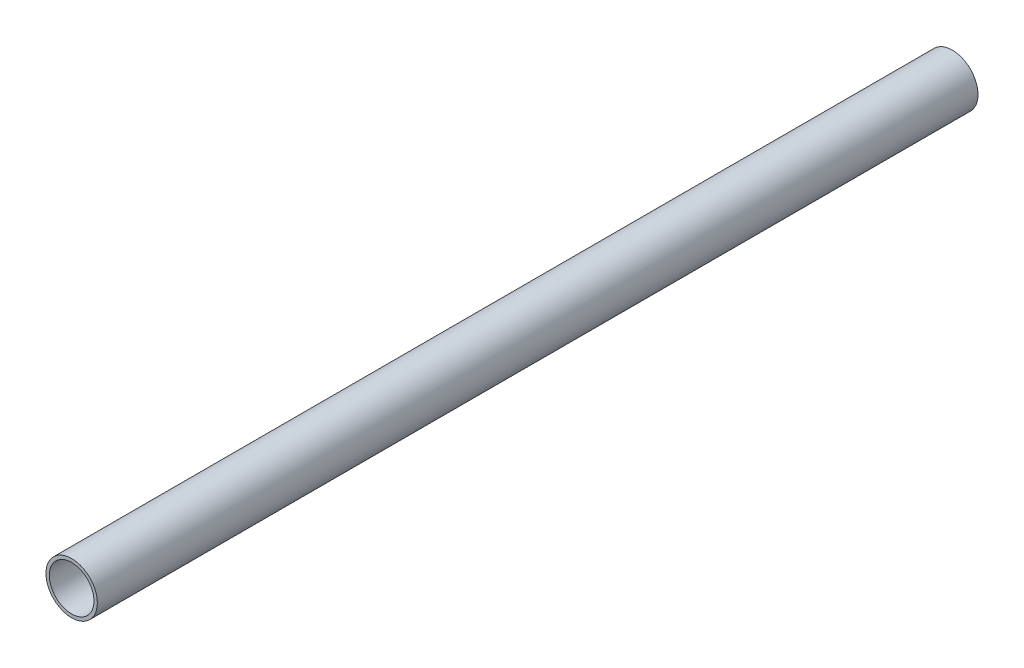
ISO-10303-21;
HEADER;
FILE_DESCRIPTION(('STEP AP214'),'2;1');
FILE_NAME('part.step','',(''),(''),'','','');
FILE_SCHEMA(('AUTOMOTIVE_DESIGN { 1 0 10303 214 1 1 1 1 }'));
ENDSEC;
DATA;
#1=APPLICATION_CONTEXT('core data for automotive mechanical design processes');
#2=APPLICATION_PROTOCOL_DEFINITION('international standard','automotive_design',2000,#1);
#3=PRODUCT_CONTEXT('',#1,'mechanical');
#4=PRODUCT('Part','Part','',(#3));
#5=PRODUCT_RELATED_PRODUCT_CATEGORY('part','',(#4));
#6=PRODUCT_DEFINITION_FORMATION('','',#4);
#7=PRODUCT_DEFINITION_CONTEXT('part definition',#1,'design');
#8=PRODUCT_DEFINITION('design','',#6,#7);
#9=PRODUCT_DEFINITION_SHAPE('','',#8);
#10=(LENGTH_UNIT() NAMED_UNIT(*) SI_UNIT(.MILLI.,.METRE.));
#11=(NAMED_UNIT(*) PLANE_ANGLE_UNIT() SI_UNIT($,.RADIAN.));
#12=(NAMED_UNIT(*) SI_UNIT($,.STERADIAN.) SOLID_ANGLE_UNIT());
#13=UNCERTAINTY_MEASURE_WITH_UNIT(LENGTH_MEASURE(1.E-05),#10,'distance_accuracy_value','');
#14=(GEOMETRIC_REPRESENTATION_CONTEXT(3) GLOBAL_UNCERTAINTY_ASSIGNED_CONTEXT((#13)) GLOBAL_UNIT_ASSIGNED_CONTEXT((#10,
#11,#12)) REPRESENTATION_CONTEXT('',''));
#15=CARTESIAN_POINT('',(0.,0.,0.));
#16=DIRECTION('',(0.,0.,1.));
#17=DIRECTION('',(1.,0.,0.));
#18=AXIS2_PLACEMENT_3D('',#15,#16,#17);
#19=CARTESIAN_POINT('',(0.,0.,1524.));
#20=DIRECTION('',(0.,0.,1.));
#21=DIRECTION('',(1.,0.,0.));
#22=AXIS2_PLACEMENT_3D('',#19,#20,#21);
#23=PLANE('',#22);
#24=CARTESIAN_POINT('',(0.,0.,1524.));
#25=DIRECTION('',(0.,0.,1.));
#26=DIRECTION('',(1.,0.,0.));
#27=AXIS2_PLACEMENT_3D('',#24,#25,#26);
#28=CIRCLE('',#27,44.45);
#29=CARTESIAN_POINT('',(44.45,0.,1524.));
#30=VERTEX_POINT('',#29);
#31=EDGE_CURVE('E10',#30,#30,#28,.T.);
#32=ORIENTED_EDGE('',*,*,#31,.T.);
#33=EDGE_LOOP('',(#32));
#34=FACE_BOUND('',#33,.T.);
#35=CARTESIAN_POINT('',(0.,0.,1524.));
#36=DIRECTION('',(0.,0.,1.));
#37=DIRECTION('',(1.,0.,0.));
#38=AXIS2_PLACEMENT_3D('',#35,#36,#37);
#39=CIRCLE('',#38,38.6334);
#40=CARTESIAN_POINT('',(38.6334,0.,1524.));
#41=VERTEX_POINT('',#40);
#42=EDGE_CURVE('E43',#41,#41,#39,.T.);
#43=ORIENTED_EDGE('',*,*,#42,.F.);
#44=EDGE_LOOP('',(#43));
#45=FACE_BOUND('',#44,.T.);
#46=ADVANCED_FACE('F32',(#34,#45),#23,.T.);
#47=CARTESIAN_POINT('',(0.,0.,0.));
#48=DIRECTION('',(0.,0.,1.));
#49=DIRECTION('',(1.,0.,0.));
#50=AXIS2_PLACEMENT_3D('',#47,#48,#49);
#51=PLANE('',#50);
#52=CARTESIAN_POINT('',(0.,0.,0.));
#53=DIRECTION('',(0.,0.,1.));
#54=DIRECTION('',(1.,0.,0.));
#55=AXIS2_PLACEMENT_3D('',#52,#53,#54);
#56=CIRCLE('',#55,44.45);
#57=CARTESIAN_POINT('',(44.45,0.,0.));
#58=VERTEX_POINT('',#57);
#59=EDGE_CURVE('E36',#58,#58,#56,.T.);
#60=ORIENTED_EDGE('',*,*,#59,.F.);
#61=EDGE_LOOP('',(#60));
#62=FACE_BOUND('',#61,.T.);
#63=CARTESIAN_POINT('',(0.,0.,0.));
#64=DIRECTION('',(0.,0.,1.));
#65=DIRECTION('',(1.,0.,0.));
#66=AXIS2_PLACEMENT_3D('',#63,#64,#65);
#67=CIRCLE('',#66,38.6334);
#68=CARTESIAN_POINT('',(38.6334,0.,0.));
#69=VERTEX_POINT('',#68);
#70=EDGE_CURVE('E45',#69,#69,#67,.T.);
#71=ORIENTED_EDGE('',*,*,#70,.T.);
#72=EDGE_LOOP('',(#71));
#73=FACE_BOUND('',#72,.T.);
#74=ADVANCED_FACE('F55',(#62,#73),#51,.F.);
#75=CARTESIAN_POINT('',(0.,0.,1524.));
#76=DIRECTION('',(0.,0.,-1.));
#77=DIRECTION('',(-1.,0.,0.));
#78=AXIS2_PLACEMENT_3D('',#75,#76,#77);
#79=CYLINDRICAL_SURFACE('',#78,44.45);
#80=ORIENTED_EDGE('',*,*,#31,.F.);
#81=EDGE_LOOP('',(#80));
#82=FACE_BOUND('',#81,.T.);
#83=ORIENTED_EDGE('',*,*,#59,.T.);
#84=EDGE_LOOP('',(#83));
#85=FACE_BOUND('',#84,.T.);
#86=ADVANCED_FACE('F34',(#82,#85),#79,.T.);
#87=CARTESIAN_POINT('',(0.,0.,1524.));
#88=DIRECTION('',(0.,0.,-1.));
#89=DIRECTION('',(-1.,0.,0.));
#90=AXIS2_PLACEMENT_3D('',#87,#88,#89);
#91=CYLINDRICAL_SURFACE('',#90,38.6334);
#92=ORIENTED_EDGE('',*,*,#42,.T.);
#93=EDGE_LOOP('',(#92));
#94=FACE_BOUND('',#93,.T.);
#95=ORIENTED_EDGE('',*,*,#70,.F.);
#96=EDGE_LOOP('',(#95));
#97=FACE_BOUND('',#96,.T.);
#98=ADVANCED_FACE('F51',(#94,#97),#91,.F.);
#99=CLOSED_SHELL('',(#46,#74,#86,#98));
#100=MANIFOLD_SOLID_BREP('B2',#99);
#101=ADVANCED_BREP_SHAPE_REPRESENTATION('',(#18,#100),#14);
#102=SHAPE_DEFINITION_REPRESENTATION(#9,#101);
ENDSEC;
END-ISO-10303-21;
